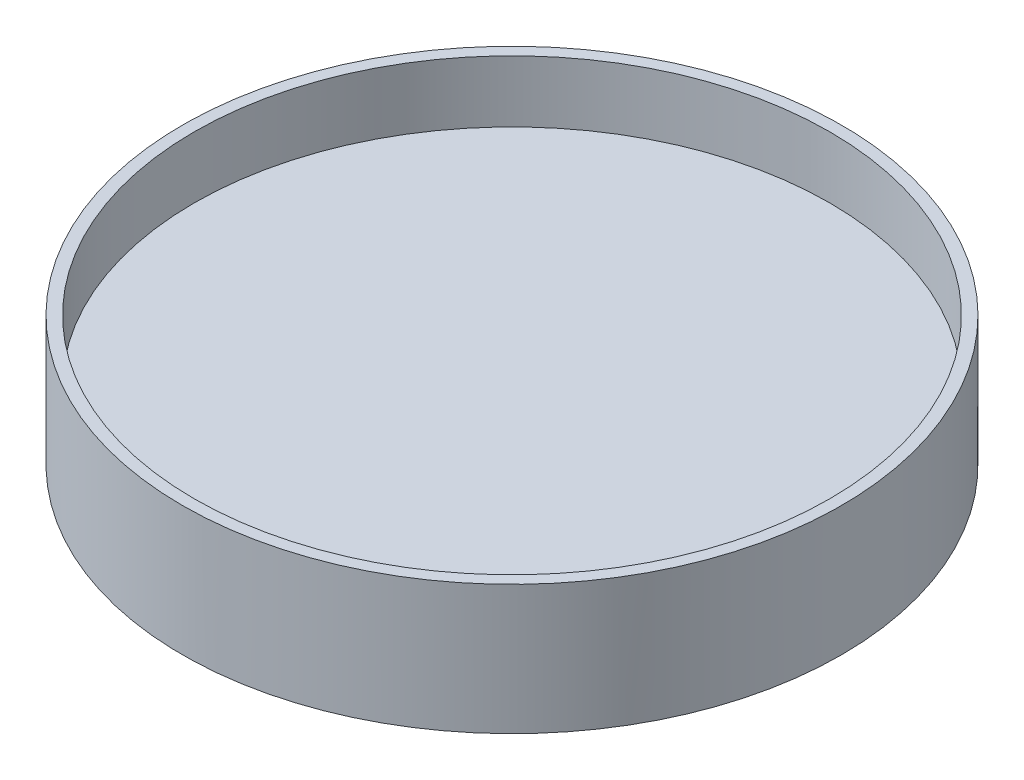
ISO-10303-21;
HEADER;
FILE_DESCRIPTION(('STEP AP214'),'2;1');
FILE_NAME('part.step','',(''),(''),'','','');
FILE_SCHEMA(('AUTOMOTIVE_DESIGN { 1 0 10303 214 1 1 1 1 }'));
ENDSEC;
DATA;
#1=APPLICATION_CONTEXT('core data for automotive mechanical design processes');
#2=APPLICATION_PROTOCOL_DEFINITION('international standard','automotive_design',2000,#1);
#3=PRODUCT_CONTEXT('',#1,'mechanical');
#4=PRODUCT('Part','Part','',(#3));
#5=PRODUCT_RELATED_PRODUCT_CATEGORY('part','',(#4));
#6=PRODUCT_DEFINITION_FORMATION('','',#4);
#7=PRODUCT_DEFINITION_CONTEXT('part definition',#1,'design');
#8=PRODUCT_DEFINITION('design','',#6,#7);
#9=PRODUCT_DEFINITION_SHAPE('','',#8);
#10=(LENGTH_UNIT() NAMED_UNIT(*) SI_UNIT(.MILLI.,.METRE.));
#11=(NAMED_UNIT(*) PLANE_ANGLE_UNIT() SI_UNIT($,.RADIAN.));
#12=(NAMED_UNIT(*) SI_UNIT($,.STERADIAN.) SOLID_ANGLE_UNIT());
#13=UNCERTAINTY_MEASURE_WITH_UNIT(LENGTH_MEASURE(1.E-05),#10,'distance_accuracy_value','');
#14=(GEOMETRIC_REPRESENTATION_CONTEXT(3) GLOBAL_UNCERTAINTY_ASSIGNED_CONTEXT((#13)) GLOBAL_UNIT_ASSIGNED_CONTEXT((#10,
#11,#12)) REPRESENTATION_CONTEXT('',''));
#15=CARTESIAN_POINT('',(0.,0.,0.));
#16=DIRECTION('',(0.,0.,1.));
#17=DIRECTION('',(1.,0.,0.));
#18=AXIS2_PLACEMENT_3D('',#15,#16,#17);
#19=CARTESIAN_POINT('',(0.,2.,0.));
#20=DIRECTION('',(0.,-1.,0.));
#21=DIRECTION('',(0.,0.,-1.));
#22=AXIS2_PLACEMENT_3D('',#19,#20,#21);
#23=CYLINDRICAL_SURFACE('',#22,53.5);
#24=CARTESIAN_POINT('',(0.,-51.9545935501832,0.));
#25=DIRECTION('',(0.939692620785908,-0.342020143325669,0.));
#26=DIRECTION('',(-0.342020143325669,-0.939692620785909,0.));
#27=AXIS2_PLACEMENT_3D('',#24,#25,#26);
#28=ELLIPSE('',#27,156.423535408725,53.5);
#29=CARTESIAN_POINT('',(15.6341934772697,-9.,-51.1646557138353));
#30=VERTEX_POINT('',#29);
#31=CARTESIAN_POINT('',(18.,-2.5,-50.3810480240338));
#32=VERTEX_POINT('',#31);
#33=EDGE_CURVE('E125',#30,#32,#28,.T.);
#34=ORIENTED_EDGE('',*,*,#33,.T.);
#35=DIRECTION('',(0.,-1.,0.));
#36=VECTOR('',#35,1.);
#37=CARTESIAN_POINT('',(18.,2.,-50.3810480240338));
#38=LINE('',#37,#36);
#39=CARTESIAN_POINT('',(18.,-0.5,-50.3810480240338));
#40=VERTEX_POINT('',#39);
#41=EDGE_CURVE('E117',#32,#40,#38,.F.);
#42=ORIENTED_EDGE('',*,*,#41,.T.);
#43=CARTESIAN_POINT('',(0.,-0.5,0.));
#44=DIRECTION('',(0.,1.,0.));
#45=DIRECTION('',(0.,0.,1.));
#46=AXIS2_PLACEMENT_3D('',#43,#44,#45);
#47=CIRCLE('',#46,53.5);
#48=CARTESIAN_POINT('',(-18.,-0.5,-50.3810480240338));
#49=VERTEX_POINT('',#48);
#50=EDGE_CURVE('E97',#40,#49,#47,.T.);
#51=ORIENTED_EDGE('',*,*,#50,.T.);
#52=DIRECTION('',(0.,-1.,0.));
#53=VECTOR('',#52,1.);
#54=CARTESIAN_POINT('',(-18.,2.,-50.3810480240338));
#55=LINE('',#54,#53);
#56=CARTESIAN_POINT('',(-18.,-2.5,-50.3810480240338));
#57=VERTEX_POINT('',#56);
#58=EDGE_CURVE('E114',#49,#57,#55,.T.);
#59=ORIENTED_EDGE('',*,*,#58,.T.);
#60=CARTESIAN_POINT('',(0.,-51.9545935501831,0.));
#61=DIRECTION('',(-0.939692620785908,-0.342020143325669,0.));
#62=DIRECTION('',(0.342020143325669,-0.939692620785908,0.));
#63=AXIS2_PLACEMENT_3D('',#60,#61,#62);
#64=ELLIPSE('',#63,156.423535408725,53.5);
#65=CARTESIAN_POINT('',(-15.6341934772697,-9.,-51.1646557138353));
#66=VERTEX_POINT('',#65);
#67=EDGE_CURVE('E122',#57,#66,#64,.T.);
#68=ORIENTED_EDGE('',*,*,#67,.T.);
#69=CARTESIAN_POINT('',(0.,-9.,0.));
#70=DIRECTION('',(0.,-1.,0.));
#71=DIRECTION('',(0.,0.,-1.));
#72=AXIS2_PLACEMENT_3D('',#69,#70,#71);
#73=CIRCLE('',#72,53.5);
#74=EDGE_CURVE('E135',#30,#66,#73,.T.);
#75=ORIENTED_EDGE('',*,*,#74,.F.);
#76=EDGE_LOOP('',(#34,#42,#51,#59,#68,#75));
#77=FACE_BOUND('',#76,.T.);
#78=CARTESIAN_POINT('',(0.,12.,0.));
#79=DIRECTION('',(0.,1.,0.));
#80=DIRECTION('',(0.,0.,1.));
#81=AXIS2_PLACEMENT_3D('',#78,#79,#80);
#82=CIRCLE('',#81,53.5);
#83=CARTESIAN_POINT('',(0.,12.,53.5));
#84=VERTEX_POINT('',#83);
#85=EDGE_CURVE('E44',#84,#84,#82,.T.);
#86=ORIENTED_EDGE('',*,*,#85,.F.);
#87=EDGE_LOOP('',(#86));
#88=FACE_BOUND('',#87,.T.);
#89=ADVANCED_FACE('F35',(#77,#88),#23,.T.);
#90=CARTESIAN_POINT('',(0.,12.,0.));
#91=DIRECTION('',(0.,1.,0.));
#92=DIRECTION('',(0.,0.,1.));
#93=AXIS2_PLACEMENT_3D('',#90,#91,#92);
#94=PLANE('',#93);
#95=ORIENTED_EDGE('',*,*,#85,.T.);
#96=EDGE_LOOP('',(#95));
#97=FACE_BOUND('',#96,.T.);
#98=CARTESIAN_POINT('',(0.,12.,0.));
#99=DIRECTION('',(0.,1.,0.));
#100=DIRECTION('',(0.,0.,1.));
#101=AXIS2_PLACEMENT_3D('',#98,#99,#100);
#102=CIRCLE('',#101,51.6);
#103=CARTESIAN_POINT('',(0.,12.,51.6));
#104=VERTEX_POINT('',#103);
#105=EDGE_CURVE('E138',#104,#104,#102,.T.);
#106=ORIENTED_EDGE('',*,*,#105,.F.);
#107=EDGE_LOOP('',(#106));
#108=FACE_BOUND('',#107,.T.);
#109=ADVANCED_FACE('F177',(#97,#108),#94,.T.);
#110=CARTESIAN_POINT('',(0.,12.,0.));
#111=DIRECTION('',(0.,-1.,0.));
#112=DIRECTION('',(0.,0.,-1.));
#113=AXIS2_PLACEMENT_3D('',#110,#111,#112);
#114=CYLINDRICAL_SURFACE('',#113,51.6);
#115=ORIENTED_EDGE('',*,*,#105,.T.);
#116=EDGE_LOOP('',(#115));
#117=FACE_BOUND('',#116,.T.);
#118=CARTESIAN_POINT('',(0.,2.,0.));
#119=DIRECTION('',(0.,1.,0.));
#120=DIRECTION('',(0.,0.,1.));
#121=AXIS2_PLACEMENT_3D('',#118,#119,#120);
#122=CIRCLE('',#121,51.6);
#123=CARTESIAN_POINT('',(0.,2.,51.6));
#124=VERTEX_POINT('',#123);
#125=EDGE_CURVE('E11',#124,#124,#122,.F.);
#126=ORIENTED_EDGE('',*,*,#125,.T.);
#127=EDGE_LOOP('',(#126));
#128=FACE_BOUND('',#127,.T.);
#129=ADVANCED_FACE('F182',(#117,#128),#114,.F.);
#130=CARTESIAN_POINT('',(0.,2.,0.));
#131=DIRECTION('',(0.,1.,0.));
#132=DIRECTION('',(0.,0.,1.));
#133=AXIS2_PLACEMENT_3D('',#130,#131,#132);
#134=PLANE('',#133);
#135=ORIENTED_EDGE('',*,*,#125,.F.);
#136=EDGE_LOOP('',(#135));
#137=FACE_BOUND('',#136,.T.);
#138=ADVANCED_FACE('F187',(#137),#134,.T.);
#139=CARTESIAN_POINT('',(0.,-9.,0.));
#140=DIRECTION('',(0.,-1.,0.));
#141=DIRECTION('',(0.,0.,-1.));
#142=AXIS2_PLACEMENT_3D('',#139,#140,#141);
#143=PLANE('',#142);
#144=DIRECTION('',(0.,0.,-1.));
#145=VECTOR('',#144,1.);
#146=CARTESIAN_POINT('',(15.6341934772697,-9.,0.));
#147=LINE('',#146,#145);
#148=CARTESIAN_POINT('',(15.6341934772697,-9.,15.6341934772697));
#149=VERTEX_POINT('',#148);
#150=EDGE_CURVE('E52',#30,#149,#147,.F.);
#151=ORIENTED_EDGE('',*,*,#150,.F.);
#152=ORIENTED_EDGE('',*,*,#74,.T.);
#153=DIRECTION('',(0.,0.,1.));
#154=VECTOR('',#153,1.);
#155=CARTESIAN_POINT('',(-15.6341934772697,-9.,0.));
#156=LINE('',#155,#154);
#157=CARTESIAN_POINT('',(-15.6341934772697,-9.,15.6341934772697));
#158=VERTEX_POINT('',#157);
#159=EDGE_CURVE('E130',#158,#66,#156,.F.);
#160=ORIENTED_EDGE('',*,*,#159,.F.);
#161=DIRECTION('',(1.,0.,0.));
#162=VECTOR('',#161,1.);
#163=CARTESIAN_POINT('',(0.,-9.,15.6341934772697));
#164=LINE('',#163,#162);
#165=EDGE_CURVE('E147',#149,#158,#164,.F.);
#166=ORIENTED_EDGE('',*,*,#165,.F.);
#167=EDGE_LOOP('',(#151,#152,#160,#166));
#168=FACE_BOUND('',#167,.T.);
#169=ADVANCED_FACE('F156',(#168),#143,.T.);
#170=CARTESIAN_POINT('',(18.,-2.5,-18.));
#171=DIRECTION('',(-0.939692620785908,0.342020143325669,0.));
#172=DIRECTION('',(-0.342020143325669,-0.939692620785908,0.));
#173=AXIS2_PLACEMENT_3D('',#170,#171,#172);
#174=PLANE('',#173);
#175=ORIENTED_EDGE('',*,*,#150,.T.);
#176=DIRECTION('',(-0.323615577118185,-0.889126490715988,-0.323615577118185));
#177=VECTOR('',#176,1.);
#178=CARTESIAN_POINT('',(14.2298264968727,-12.8584665672684,14.2298264968727));
#179=LINE('',#178,#177);
#180=CARTESIAN_POINT('',(18.,-2.5,18.));
#181=VERTEX_POINT('',#180);
#182=EDGE_CURVE('E134',#181,#149,#179,.T.);
#183=ORIENTED_EDGE('',*,*,#182,.F.);
#184=DIRECTION('',(0.,0.,1.));
#185=VECTOR('',#184,1.);
#186=CARTESIAN_POINT('',(18.,-2.5,-18.));
#187=LINE('',#186,#185);
#188=EDGE_CURVE('E103',#32,#181,#187,.T.);
#189=ORIENTED_EDGE('',*,*,#188,.F.);
#190=ORIENTED_EDGE('',*,*,#33,.F.);
#191=EDGE_LOOP('',(#175,#183,#189,#190));
#192=FACE_BOUND('',#191,.T.);
#193=ADVANCED_FACE('F189',(#192),#174,.T.);
#194=CARTESIAN_POINT('',(-18.,-2.5,-18.));
#195=DIRECTION('',(0.939692620785908,0.342020143325669,0.));
#196=DIRECTION('',(-0.342020143325669,0.939692620785908,0.));
#197=AXIS2_PLACEMENT_3D('',#194,#195,#196);
#198=PLANE('',#197);
#199=ORIENTED_EDGE('',*,*,#159,.T.);
#200=ORIENTED_EDGE('',*,*,#67,.F.);
#201=DIRECTION('',(0.,0.,-1.));
#202=VECTOR('',#201,1.);
#203=CARTESIAN_POINT('',(-18.,-2.5,-18.));
#204=LINE('',#203,#202);
#205=CARTESIAN_POINT('',(-18.,-2.5,18.));
#206=VERTEX_POINT('',#205);
#207=EDGE_CURVE('E132',#206,#57,#204,.T.);
#208=ORIENTED_EDGE('',*,*,#207,.F.);
#209=DIRECTION('',(0.323615577118185,-0.889126490715988,-0.323615577118185));
#210=VECTOR('',#209,1.);
#211=CARTESIAN_POINT('',(-18.,-2.5,18.));
#212=LINE('',#211,#210);
#213=EDGE_CURVE('E139',#206,#158,#212,.T.);
#214=ORIENTED_EDGE('',*,*,#213,.T.);
#215=EDGE_LOOP('',(#199,#200,#208,#214));
#216=FACE_BOUND('',#215,.T.);
#217=ADVANCED_FACE('F160',(#216),#198,.T.);
#218=CARTESIAN_POINT('',(-18.,-2.5,18.));
#219=DIRECTION('',(0.,0.342020143325669,-0.939692620785908));
#220=DIRECTION('',(0.,0.939692620785908,0.342020143325669));
#221=AXIS2_PLACEMENT_3D('',#218,#219,#220);
#222=PLANE('',#221);
#223=ORIENTED_EDGE('',*,*,#165,.T.);
#224=ORIENTED_EDGE('',*,*,#213,.F.);
#225=DIRECTION('',(-1.,0.,0.));
#226=VECTOR('',#225,1.);
#227=CARTESIAN_POINT('',(-18.,-2.5,18.));
#228=LINE('',#227,#226);
#229=EDGE_CURVE('E129',#181,#206,#228,.T.);
#230=ORIENTED_EDGE('',*,*,#229,.F.);
#231=ORIENTED_EDGE('',*,*,#182,.T.);
#232=EDGE_LOOP('',(#223,#224,#230,#231));
#233=FACE_BOUND('',#232,.T.);
#234=ADVANCED_FACE('F37',(#233),#222,.T.);
#235=CARTESIAN_POINT('',(18.,-0.5,18.));
#236=DIRECTION('',(1.,0.,0.));
#237=DIRECTION('',(0.,0.,-1.));
#238=AXIS2_PLACEMENT_3D('',#235,#236,#237);
#239=PLANE('',#238);
#240=ORIENTED_EDGE('',*,*,#188,.T.);
#241=DIRECTION('',(0.,-1.,0.));
#242=VECTOR('',#241,1.);
#243=CARTESIAN_POINT('',(18.,-0.5,18.));
#244=LINE('',#243,#242);
#245=CARTESIAN_POINT('',(18.,-0.5,18.));
#246=VERTEX_POINT('',#245);
#247=EDGE_CURVE('E61',#246,#181,#244,.T.);
#248=ORIENTED_EDGE('',*,*,#247,.F.);
#249=DIRECTION('',(0.,0.,1.));
#250=VECTOR('',#249,1.);
#251=CARTESIAN_POINT('',(18.,-0.5,18.));
#252=LINE('',#251,#250);
#253=EDGE_CURVE('E93',#40,#246,#252,.T.);
#254=ORIENTED_EDGE('',*,*,#253,.F.);
#255=ORIENTED_EDGE('',*,*,#41,.F.);
#256=EDGE_LOOP('',(#240,#248,#254,#255));
#257=FACE_BOUND('',#256,.T.);
#258=ADVANCED_FACE('F101',(#257),#239,.F.);
#259=CARTESIAN_POINT('',(-18.,-0.5,18.));
#260=DIRECTION('',(-1.,0.,0.));
#261=DIRECTION('',(0.,0.,1.));
#262=AXIS2_PLACEMENT_3D('',#259,#260,#261);
#263=PLANE('',#262);
#264=DIRECTION('',(0.,0.,-1.));
#265=VECTOR('',#264,1.);
#266=CARTESIAN_POINT('',(-18.,-0.5,18.));
#267=LINE('',#266,#265);
#268=CARTESIAN_POINT('',(-18.,-0.5,18.));
#269=VERTEX_POINT('',#268);
#270=EDGE_CURVE('E105',#269,#49,#267,.T.);
#271=ORIENTED_EDGE('',*,*,#270,.F.);
#272=DIRECTION('',(0.,-1.,0.));
#273=VECTOR('',#272,1.);
#274=CARTESIAN_POINT('',(-18.,-0.5,18.));
#275=LINE('',#274,#273);
#276=EDGE_CURVE('E104',#269,#206,#275,.T.);
#277=ORIENTED_EDGE('',*,*,#276,.T.);
#278=ORIENTED_EDGE('',*,*,#207,.T.);
#279=ORIENTED_EDGE('',*,*,#58,.F.);
#280=EDGE_LOOP('',(#271,#277,#278,#279));
#281=FACE_BOUND('',#280,.T.);
#282=ADVANCED_FACE('F165',(#281),#263,.F.);
#283=CARTESIAN_POINT('',(0.,-0.5,0.));
#284=DIRECTION('',(0.,1.,0.));
#285=DIRECTION('',(0.,0.,1.));
#286=AXIS2_PLACEMENT_3D('',#283,#284,#285);
#287=PLANE('',#286);
#288=CARTESIAN_POINT('',(0.,-0.5,-37.));
#289=DIRECTION('',(0.,1.,0.));
#290=DIRECTION('',(0.,0.,1.));
#291=AXIS2_PLACEMENT_3D('',#288,#289,#290);
#292=CIRCLE('',#291,2.35);
#293=CARTESIAN_POINT('',(0.,-0.5,-34.65));
#294=VERTEX_POINT('',#293);
#295=EDGE_CURVE('E39',#294,#294,#292,.F.);
#296=ORIENTED_EDGE('',*,*,#295,.F.);
#297=EDGE_LOOP('',(#296));
#298=FACE_BOUND('',#297,.T.);
#299=ORIENTED_EDGE('',*,*,#253,.T.);
#300=DIRECTION('',(-1.,0.,0.));
#301=VECTOR('',#300,1.);
#302=CARTESIAN_POINT('',(18.,-0.5,18.));
#303=LINE('',#302,#301);
#304=EDGE_CURVE('E96',#246,#269,#303,.T.);
#305=ORIENTED_EDGE('',*,*,#304,.T.);
#306=ORIENTED_EDGE('',*,*,#270,.T.);
#307=ORIENTED_EDGE('',*,*,#50,.F.);
#308=EDGE_LOOP('',(#299,#305,#306,#307));
#309=FACE_BOUND('',#308,.T.);
#310=ADVANCED_FACE('F94',(#298,#309),#287,.F.);
#311=CARTESIAN_POINT('',(18.,-0.5,18.));
#312=DIRECTION('',(0.,0.,1.));
#313=DIRECTION('',(1.,0.,0.));
#314=AXIS2_PLACEMENT_3D('',#311,#312,#313);
#315=PLANE('',#314);
#316=ORIENTED_EDGE('',*,*,#229,.T.);
#317=ORIENTED_EDGE('',*,*,#276,.F.);
#318=ORIENTED_EDGE('',*,*,#304,.F.);
#319=ORIENTED_EDGE('',*,*,#247,.T.);
#320=EDGE_LOOP('',(#316,#317,#318,#319));
#321=FACE_BOUND('',#320,.T.);
#322=ADVANCED_FACE('F107',(#321),#315,.F.);
#323=CARTESIAN_POINT('',(0.,1.5,-37.));
#324=DIRECTION('',(0.,-1.,0.));
#325=DIRECTION('',(0.,0.,-1.));
#326=AXIS2_PLACEMENT_3D('',#323,#324,#325);
#327=PLANE('',#326);
#328=CARTESIAN_POINT('',(0.,1.5,-37.));
#329=DIRECTION('',(0.,-1.,0.));
#330=DIRECTION('',(0.,0.,-1.));
#331=AXIS2_PLACEMENT_3D('',#328,#329,#330);
#332=CIRCLE('',#331,2.35);
#333=CARTESIAN_POINT('',(0.,1.5,-39.35));
#334=VERTEX_POINT('',#333);
#335=EDGE_CURVE('E119',#334,#334,#332,.T.);
#336=ORIENTED_EDGE('',*,*,#335,.T.);
#337=EDGE_LOOP('',(#336));
#338=FACE_BOUND('',#337,.T.);
#339=ADVANCED_FACE('F230',(#338),#327,.T.);
#340=CARTESIAN_POINT('',(0.,1.5,-37.));
#341=DIRECTION('',(0.,-1.,0.));
#342=DIRECTION('',(0.,0.,-1.));
#343=AXIS2_PLACEMENT_3D('',#340,#341,#342);
#344=CYLINDRICAL_SURFACE('',#343,2.35);
#345=ORIENTED_EDGE('',*,*,#295,.T.);
#346=EDGE_LOOP('',(#345));
#347=FACE_BOUND('',#346,.T.);
#348=ORIENTED_EDGE('',*,*,#335,.F.);
#349=EDGE_LOOP('',(#348));
#350=FACE_BOUND('',#349,.T.);
#351=ADVANCED_FACE('F201',(#347,#350),#344,.F.);
#352=CLOSED_SHELL('',(#89,#109,#129,#138,#169,#193,#217,#234,#258,#282,#310,#322,#339,#351));
#353=MANIFOLD_SOLID_BREP('B2',#352);
#354=ADVANCED_BREP_SHAPE_REPRESENTATION('',(#18,#353),#14);
#355=SHAPE_DEFINITION_REPRESENTATION(#9,#354);
ENDSEC;
END-ISO-10303-21;
